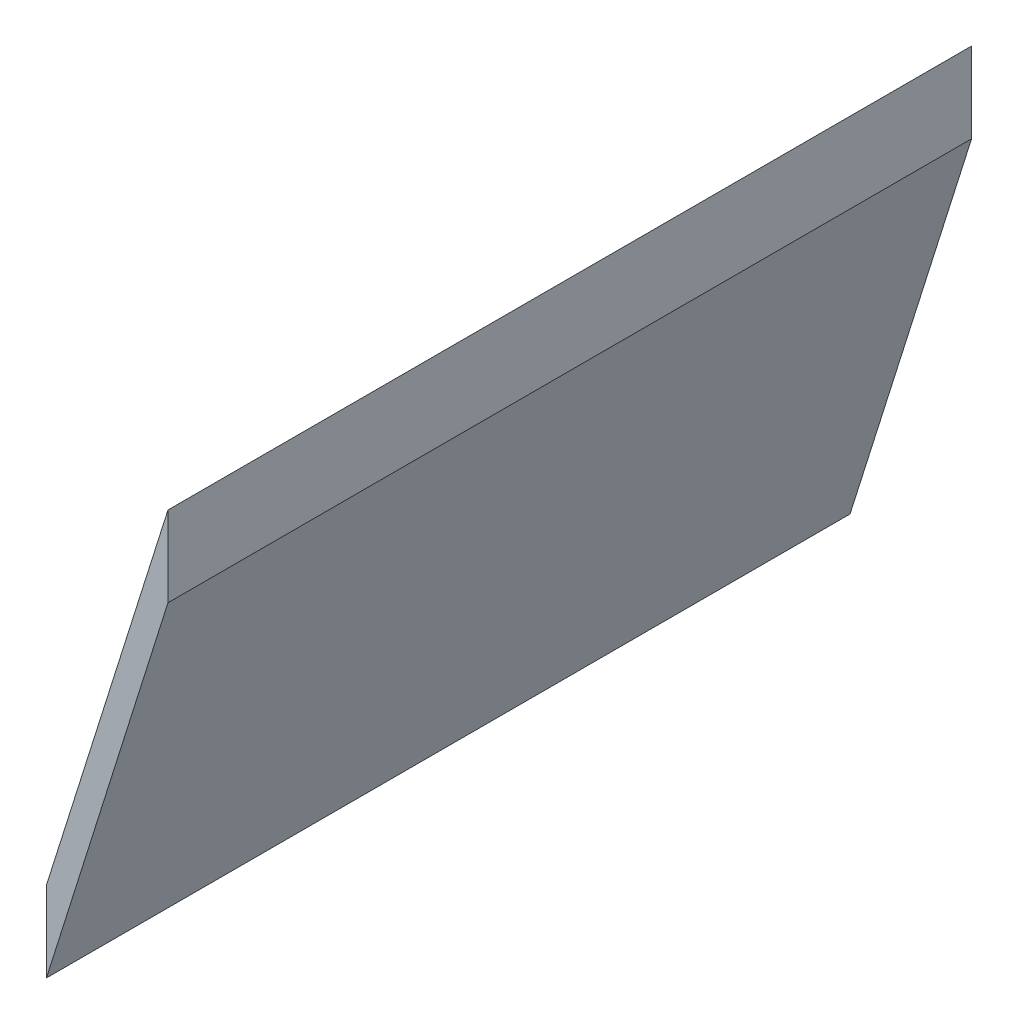
ISO-10303-21;
HEADER;
FILE_DESCRIPTION(('STEP AP214'),'2;1');
FILE_NAME('part.step','',(''),(''),'','','');
FILE_SCHEMA(('AUTOMOTIVE_DESIGN { 1 0 10303 214 1 1 1 1 }'));
ENDSEC;
DATA;
#1=APPLICATION_CONTEXT('core data for automotive mechanical design processes');
#2=APPLICATION_PROTOCOL_DEFINITION('international standard','automotive_design',2000,#1);
#3=PRODUCT_CONTEXT('',#1,'mechanical');
#4=PRODUCT('Part','Part','',(#3));
#5=PRODUCT_RELATED_PRODUCT_CATEGORY('part','',(#4));
#6=PRODUCT_DEFINITION_FORMATION('','',#4);
#7=PRODUCT_DEFINITION_CONTEXT('part definition',#1,'design');
#8=PRODUCT_DEFINITION('design','',#6,#7);
#9=PRODUCT_DEFINITION_SHAPE('','',#8);
#10=(LENGTH_UNIT() NAMED_UNIT(*) SI_UNIT(.MILLI.,.METRE.));
#11=(NAMED_UNIT(*) PLANE_ANGLE_UNIT() SI_UNIT($,.RADIAN.));
#12=(NAMED_UNIT(*) SI_UNIT($,.STERADIAN.) SOLID_ANGLE_UNIT());
#13=UNCERTAINTY_MEASURE_WITH_UNIT(LENGTH_MEASURE(1.E-05),#10,'distance_accuracy_value','');
#14=(GEOMETRIC_REPRESENTATION_CONTEXT(3) GLOBAL_UNCERTAINTY_ASSIGNED_CONTEXT((#13)) GLOBAL_UNIT_ASSIGNED_CONTEXT((#10,
#11,#12)) REPRESENTATION_CONTEXT('',''));
#15=CARTESIAN_POINT('',(0.,0.,0.));
#16=DIRECTION('',(0.,0.,1.));
#17=DIRECTION('',(1.,0.,0.));
#18=AXIS2_PLACEMENT_3D('',#15,#16,#17);
#19=CARTESIAN_POINT('',(0.71795591028076,-3.05051556849092,50.));
#20=DIRECTION('',(0.953769419284832,-0.300539339915881,0.));
#21=DIRECTION('',(0.300539339915881,0.953769419284833,0.));
#22=AXIS2_PLACEMENT_3D('',#19,#20,#21);
#23=PLANE('',#22);
#24=DIRECTION('',(-0.300539339915881,-0.953769419284832,0.));
#25=VECTOR('',#24,1.);
#26=CARTESIAN_POINT('',(0.71795591028076,-3.05051556849092,-50.));
#27=LINE('',#26,#25);
#28=CARTESIAN_POINT('',(15.8430878596562,44.9494844315091,-50.));
#29=VERTEX_POINT('',#28);
#30=CARTESIAN_POINT('',(0.71795591028076,-3.05051556849092,-50.));
#31=VERTEX_POINT('',#30);
#32=EDGE_CURVE('E107',#29,#31,#27,.T.);
#33=ORIENTED_EDGE('',*,*,#32,.T.);
#34=DIRECTION('',(0.,0.,-1.));
#35=VECTOR('',#34,1.);
#36=CARTESIAN_POINT('',(0.71795591028076,-3.05051556849092,50.));
#37=LINE('',#36,#35);
#38=CARTESIAN_POINT('',(0.71795591028076,-3.05051556849092,50.));
#39=VERTEX_POINT('',#38);
#40=EDGE_CURVE('E11',#39,#31,#37,.T.);
#41=ORIENTED_EDGE('',*,*,#40,.F.);
#42=DIRECTION('',(-0.300539339915881,-0.953769419284832,0.));
#43=VECTOR('',#42,1.);
#44=CARTESIAN_POINT('',(0.71795591028076,-3.05051556849092,50.));
#45=LINE('',#44,#43);
#46=CARTESIAN_POINT('',(15.8430878596562,44.9494844315091,50.));
#47=VERTEX_POINT('',#46);
#48=EDGE_CURVE('E91',#47,#39,#45,.T.);
#49=ORIENTED_EDGE('',*,*,#48,.F.);
#50=DIRECTION('',(0.,0.,-1.));
#51=VECTOR('',#50,1.);
#52=CARTESIAN_POINT('',(15.8430878596562,44.9494844315091,50.));
#53=LINE('',#52,#51);
#54=EDGE_CURVE('E103',#47,#29,#53,.T.);
#55=ORIENTED_EDGE('',*,*,#54,.T.);
#56=EDGE_LOOP('',(#33,#41,#49,#55));
#57=FACE_BOUND('',#56,.T.);
#58=ADVANCED_FACE('F39',(#57),#23,.F.);
#59=CARTESIAN_POINT('',(0.71795591028076,-13.0505155684909,50.));
#60=DIRECTION('',(1.,0.,0.));
#61=DIRECTION('',(0.,0.,-1.));
#62=AXIS2_PLACEMENT_3D('',#59,#60,#61);
#63=PLANE('',#62);
#64=DIRECTION('',(0.,-1.,0.));
#65=VECTOR('',#64,1.);
#66=CARTESIAN_POINT('',(0.71795591028076,-13.0505155684909,-50.));
#67=LINE('',#66,#65);
#68=CARTESIAN_POINT('',(0.71795591028076,-13.0505155684909,-50.));
#69=VERTEX_POINT('',#68);
#70=EDGE_CURVE('E96',#31,#69,#67,.T.);
#71=ORIENTED_EDGE('',*,*,#70,.T.);
#72=DIRECTION('',(0.,0.,-1.));
#73=VECTOR('',#72,1.);
#74=CARTESIAN_POINT('',(0.71795591028076,-13.0505155684909,50.));
#75=LINE('',#74,#73);
#76=CARTESIAN_POINT('',(0.71795591028076,-13.0505155684909,50.));
#77=VERTEX_POINT('',#76);
#78=EDGE_CURVE('E48',#77,#69,#75,.T.);
#79=ORIENTED_EDGE('',*,*,#78,.F.);
#80=DIRECTION('',(0.,-1.,0.));
#81=VECTOR('',#80,1.);
#82=CARTESIAN_POINT('',(0.71795591028076,-13.0505155684909,50.));
#83=LINE('',#82,#81);
#84=EDGE_CURVE('E86',#39,#77,#83,.T.);
#85=ORIENTED_EDGE('',*,*,#84,.F.);
#86=ORIENTED_EDGE('',*,*,#40,.T.);
#87=EDGE_LOOP('',(#71,#79,#85,#86));
#88=FACE_BOUND('',#87,.T.);
#89=ADVANCED_FACE('F95',(#88),#63,.F.);
#90=CARTESIAN_POINT('',(15.8430878596562,34.9494844315091,50.));
#91=DIRECTION('',(-0.953769419284832,0.300539339915881,0.));
#92=DIRECTION('',(-0.300539339915881,-0.953769419284833,0.));
#93=AXIS2_PLACEMENT_3D('',#90,#91,#92);
#94=PLANE('',#93);
#95=DIRECTION('',(0.300539339915881,0.953769419284832,0.));
#96=VECTOR('',#95,1.);
#97=CARTESIAN_POINT('',(15.8430878596562,34.9494844315091,-50.));
#98=LINE('',#97,#96);
#99=CARTESIAN_POINT('',(15.8430878596562,34.9494844315091,-50.));
#100=VERTEX_POINT('',#99);
#101=EDGE_CURVE('E73',#69,#100,#98,.T.);
#102=ORIENTED_EDGE('',*,*,#101,.T.);
#103=DIRECTION('',(0.,0.,-1.));
#104=VECTOR('',#103,1.);
#105=CARTESIAN_POINT('',(15.8430878596562,34.9494844315091,50.));
#106=LINE('',#105,#104);
#107=CARTESIAN_POINT('',(15.8430878596562,34.9494844315091,50.));
#108=VERTEX_POINT('',#107);
#109=EDGE_CURVE('E98',#108,#100,#106,.T.);
#110=ORIENTED_EDGE('',*,*,#109,.F.);
#111=DIRECTION('',(0.300539339915881,0.953769419284832,0.));
#112=VECTOR('',#111,1.);
#113=CARTESIAN_POINT('',(15.8430878596562,34.9494844315091,50.));
#114=LINE('',#113,#112);
#115=EDGE_CURVE('E89',#77,#108,#114,.T.);
#116=ORIENTED_EDGE('',*,*,#115,.F.);
#117=ORIENTED_EDGE('',*,*,#78,.T.);
#118=EDGE_LOOP('',(#102,#110,#116,#117));
#119=FACE_BOUND('',#118,.T.);
#120=ADVANCED_FACE('F99',(#119),#94,.F.);
#121=CARTESIAN_POINT('',(15.8430878596562,44.9494844315091,50.));
#122=DIRECTION('',(-1.,0.,0.));
#123=DIRECTION('',(0.,-1.,0.));
#124=AXIS2_PLACEMENT_3D('',#121,#122,#123);
#125=PLANE('',#124);
#126=DIRECTION('',(0.,1.,0.));
#127=VECTOR('',#126,1.);
#128=CARTESIAN_POINT('',(15.8430878596562,44.9494844315091,-50.));
#129=LINE('',#128,#127);
#130=EDGE_CURVE('E79',#100,#29,#129,.T.);
#131=ORIENTED_EDGE('',*,*,#130,.T.);
#132=ORIENTED_EDGE('',*,*,#54,.F.);
#133=DIRECTION('',(0.,1.,0.));
#134=VECTOR('',#133,1.);
#135=CARTESIAN_POINT('',(15.8430878596562,44.9494844315091,50.));
#136=LINE('',#135,#134);
#137=EDGE_CURVE('E56',#108,#47,#136,.T.);
#138=ORIENTED_EDGE('',*,*,#137,.F.);
#139=ORIENTED_EDGE('',*,*,#109,.T.);
#140=EDGE_LOOP('',(#131,#132,#138,#139));
#141=FACE_BOUND('',#140,.T.);
#142=ADVANCED_FACE('F120',(#141),#125,.F.);
#143=CARTESIAN_POINT('',(0.,0.,50.));
#144=DIRECTION('',(0.,0.,-1.));
#145=DIRECTION('',(-1.,0.,0.));
#146=AXIS2_PLACEMENT_3D('',#143,#144,#145);
#147=PLANE('',#146);
#148=ORIENTED_EDGE('',*,*,#48,.T.);
#149=ORIENTED_EDGE('',*,*,#84,.T.);
#150=ORIENTED_EDGE('',*,*,#115,.T.);
#151=ORIENTED_EDGE('',*,*,#137,.T.);
#152=EDGE_LOOP('',(#148,#149,#150,#151));
#153=FACE_BOUND('',#152,.T.);
#154=ADVANCED_FACE('F87',(#153),#147,.F.);
#155=CARTESIAN_POINT('',(0.,0.,-50.));
#156=DIRECTION('',(0.,0.,-1.));
#157=DIRECTION('',(-1.,0.,0.));
#158=AXIS2_PLACEMENT_3D('',#155,#156,#157);
#159=PLANE('',#158);
#160=ORIENTED_EDGE('',*,*,#32,.F.);
#161=ORIENTED_EDGE('',*,*,#130,.F.);
#162=ORIENTED_EDGE('',*,*,#101,.F.);
#163=ORIENTED_EDGE('',*,*,#70,.F.);
#164=EDGE_LOOP('',(#160,#161,#162,#163));
#165=FACE_BOUND('',#164,.T.);
#166=ADVANCED_FACE('F123',(#165),#159,.T.);
#167=CLOSED_SHELL('',(#58,#89,#120,#142,#154,#166));
#168=MANIFOLD_SOLID_BREP('B2',#167);
#169=ADVANCED_BREP_SHAPE_REPRESENTATION('',(#18,#168),#14);
#170=SHAPE_DEFINITION_REPRESENTATION(#9,#169);
ENDSEC;
END-ISO-10303-21;
